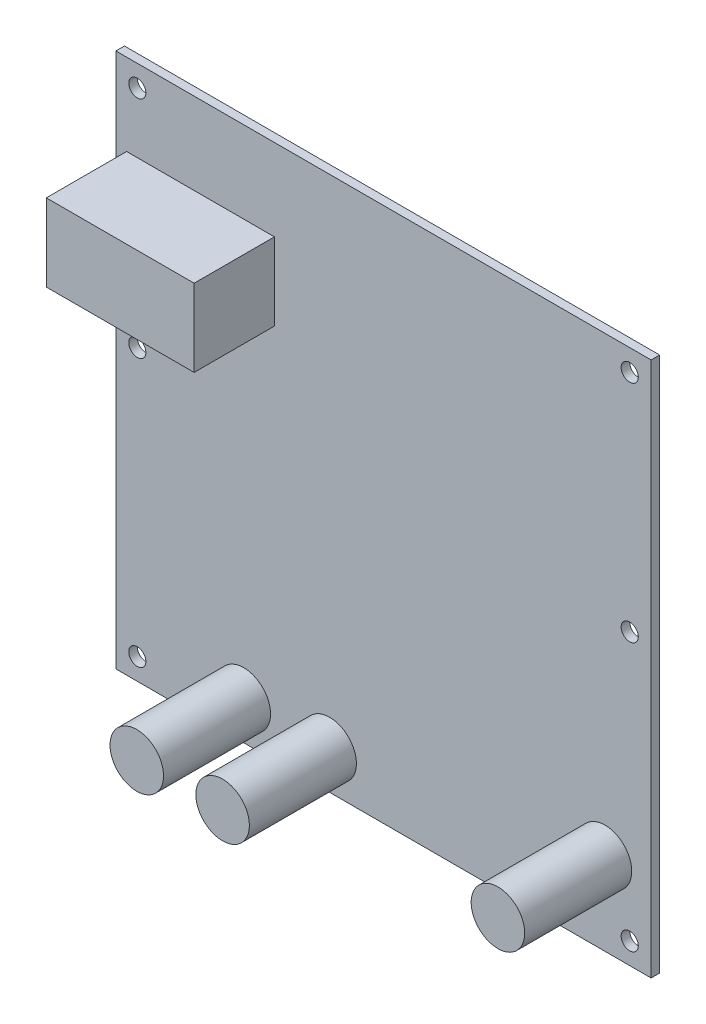
ISO-10303-21;
HEADER;
FILE_DESCRIPTION(('STEP AP214'),'2;1');
FILE_NAME('part.step','',(''),(''),'','','');
FILE_SCHEMA(('AUTOMOTIVE_DESIGN { 1 0 10303 214 1 1 1 1 }'));
ENDSEC;
DATA;
#1=APPLICATION_CONTEXT('core data for automotive mechanical design processes');
#2=APPLICATION_PROTOCOL_DEFINITION('international standard','automotive_design',2000,#1);
#3=PRODUCT_CONTEXT('',#1,'mechanical');
#4=PRODUCT('Part','Part','',(#3));
#5=PRODUCT_RELATED_PRODUCT_CATEGORY('part','',(#4));
#6=PRODUCT_DEFINITION_FORMATION('','',#4);
#7=PRODUCT_DEFINITION_CONTEXT('part definition',#1,'design');
#8=PRODUCT_DEFINITION('design','',#6,#7);
#9=PRODUCT_DEFINITION_SHAPE('','',#8);
#10=(LENGTH_UNIT() NAMED_UNIT(*) SI_UNIT(.MILLI.,.METRE.));
#11=(NAMED_UNIT(*) PLANE_ANGLE_UNIT() SI_UNIT($,.RADIAN.));
#12=(NAMED_UNIT(*) SI_UNIT($,.STERADIAN.) SOLID_ANGLE_UNIT());
#13=UNCERTAINTY_MEASURE_WITH_UNIT(LENGTH_MEASURE(1.E-05),#10,'distance_accuracy_value','');
#14=(GEOMETRIC_REPRESENTATION_CONTEXT(3) GLOBAL_UNCERTAINTY_ASSIGNED_CONTEXT((#13)) GLOBAL_UNIT_ASSIGNED_CONTEXT((#10,
#11,#12)) REPRESENTATION_CONTEXT('',''));
#15=CARTESIAN_POINT('',(0.,0.,0.));
#16=DIRECTION('',(0.,0.,1.));
#17=DIRECTION('',(1.,0.,0.));
#18=AXIS2_PLACEMENT_3D('',#15,#16,#17);
#19=CARTESIAN_POINT('',(0.,0.,1.6));
#20=DIRECTION('',(0.,0.,1.));
#21=DIRECTION('',(1.,0.,0.));
#22=AXIS2_PLACEMENT_3D('',#19,#20,#21);
#23=PLANE('',#22);
#24=CARTESIAN_POINT('',(41.3767384185348,-34.563702956973,1.6));
#25=DIRECTION('',(0.,0.,1.));
#26=DIRECTION('',(1.,0.,0.));
#27=AXIS2_PLACEMENT_3D('',#24,#25,#26);
#28=CIRCLE('',#27,5.);
#29=CARTESIAN_POINT('',(46.3767384185348,-34.563702956973,1.6));
#30=VERTEX_POINT('',#29);
#31=EDGE_CURVE('E132',#30,#30,#28,.T.);
#32=ORIENTED_EDGE('',*,*,#31,.F.);
#33=EDGE_LOOP('',(#32));
#34=FACE_BOUND('',#33,.T.);
#35=CARTESIAN_POINT('',(-10.0631145723398,-42.8428662130074,1.6));
#36=DIRECTION('',(0.,0.,1.));
#37=DIRECTION('',(1.,0.,0.));
#38=AXIS2_PLACEMENT_3D('',#35,#36,#37);
#39=CIRCLE('',#38,5.);
#40=CARTESIAN_POINT('',(-5.06311457233977,-42.8428662130074,1.6));
#41=VERTEX_POINT('',#40);
#42=EDGE_CURVE('E141',#41,#41,#39,.T.);
#43=ORIENTED_EDGE('',*,*,#42,.F.);
#44=EDGE_LOOP('',(#43));
#45=FACE_BOUND('',#44,.T.);
#46=CARTESIAN_POINT('',(-26.0991033731983,-42.8428662130074,1.6));
#47=DIRECTION('',(0.,0.,1.));
#48=DIRECTION('',(1.,0.,0.));
#49=AXIS2_PLACEMENT_3D('',#46,#47,#48);
#50=CIRCLE('',#49,5.);
#51=CARTESIAN_POINT('',(-21.0991033731983,-42.8428662130074,1.6));
#52=VERTEX_POINT('',#51);
#53=EDGE_CURVE('E146',#52,#52,#50,.T.);
#54=ORIENTED_EDGE('',*,*,#53,.F.);
#55=EDGE_LOOP('',(#54));
#56=FACE_BOUND('',#55,.T.);
#57=CARTESIAN_POINT('',(-46.,-46.,1.6));
#58=DIRECTION('',(0.,0.,1.));
#59=DIRECTION('',(1.,0.,0.));
#60=AXIS2_PLACEMENT_3D('',#57,#58,#59);
#61=CIRCLE('',#60,1.6);
#62=CARTESIAN_POINT('',(-44.4,-46.,1.6));
#63=VERTEX_POINT('',#62);
#64=EDGE_CURVE('E161',#63,#63,#61,.T.);
#65=ORIENTED_EDGE('',*,*,#64,.F.);
#66=EDGE_LOOP('',(#65));
#67=FACE_BOUND('',#66,.T.);
#68=CARTESIAN_POINT('',(46.,4.,1.6));
#69=DIRECTION('',(0.,0.,1.));
#70=DIRECTION('',(1.,0.,0.));
#71=AXIS2_PLACEMENT_3D('',#68,#69,#70);
#72=CIRCLE('',#71,1.6);
#73=CARTESIAN_POINT('',(47.6,4.,1.6));
#74=VERTEX_POINT('',#73);
#75=EDGE_CURVE('E173',#74,#74,#72,.T.);
#76=ORIENTED_EDGE('',*,*,#75,.F.);
#77=EDGE_LOOP('',(#76));
#78=FACE_BOUND('',#77,.T.);
#79=CARTESIAN_POINT('',(-46.,46.,1.6));
#80=DIRECTION('',(0.,0.,1.));
#81=DIRECTION('',(1.,0.,0.));
#82=AXIS2_PLACEMENT_3D('',#79,#80,#81);
#83=CIRCLE('',#82,1.6);
#84=CARTESIAN_POINT('',(-44.4,46.,1.6));
#85=VERTEX_POINT('',#84);
#86=EDGE_CURVE('E185',#85,#85,#83,.T.);
#87=ORIENTED_EDGE('',*,*,#86,.F.);
#88=EDGE_LOOP('',(#87));
#89=FACE_BOUND('',#88,.T.);
#90=DIRECTION('',(0.,-1.,0.));
#91=VECTOR('',#90,1.);
#92=CARTESIAN_POINT('',(-50.,50.,1.6));
#93=LINE('',#92,#91);
#94=CARTESIAN_POINT('',(-50.,50.,1.6));
#95=VERTEX_POINT('',#94);
#96=CARTESIAN_POINT('',(-50.,-50.,1.6));
#97=VERTEX_POINT('',#96);
#98=EDGE_CURVE('E191',#95,#97,#93,.T.);
#99=ORIENTED_EDGE('',*,*,#98,.T.);
#100=DIRECTION('',(1.,0.,0.));
#101=VECTOR('',#100,1.);
#102=CARTESIAN_POINT('',(-50.,-50.,1.6));
#103=LINE('',#102,#101);
#104=CARTESIAN_POINT('',(50.,-50.,1.6));
#105=VERTEX_POINT('',#104);
#106=EDGE_CURVE('E85',#97,#105,#103,.T.);
#107=ORIENTED_EDGE('',*,*,#106,.T.);
#108=DIRECTION('',(0.,1.,0.));
#109=VECTOR('',#108,1.);
#110=CARTESIAN_POINT('',(50.,50.,1.6));
#111=LINE('',#110,#109);
#112=CARTESIAN_POINT('',(50.,50.,1.6));
#113=VERTEX_POINT('',#112);
#114=EDGE_CURVE('E194',#105,#113,#111,.T.);
#115=ORIENTED_EDGE('',*,*,#114,.T.);
#116=DIRECTION('',(-1.,0.,0.));
#117=VECTOR('',#116,1.);
#118=CARTESIAN_POINT('',(-50.,50.,1.6));
#119=LINE('',#118,#117);
#120=EDGE_CURVE('E57',#113,#95,#119,.T.);
#121=ORIENTED_EDGE('',*,*,#120,.T.);
#122=EDGE_LOOP('',(#99,#107,#115,#121));
#123=FACE_BOUND('',#122,.T.);
#124=CARTESIAN_POINT('',(46.,46.,1.6));
#125=DIRECTION('',(0.,0.,1.));
#126=DIRECTION('',(1.,0.,0.));
#127=AXIS2_PLACEMENT_3D('',#124,#125,#126);
#128=CIRCLE('',#127,1.6);
#129=CARTESIAN_POINT('',(47.6,46.,1.6));
#130=VERTEX_POINT('',#129);
#131=EDGE_CURVE('E179',#130,#130,#128,.T.);
#132=ORIENTED_EDGE('',*,*,#131,.F.);
#133=EDGE_LOOP('',(#132));
#134=FACE_BOUND('',#133,.T.);
#135=CARTESIAN_POINT('',(-46.,4.,1.6));
#136=DIRECTION('',(0.,0.,1.));
#137=DIRECTION('',(1.,0.,0.));
#138=AXIS2_PLACEMENT_3D('',#135,#136,#137);
#139=CIRCLE('',#138,1.6);
#140=CARTESIAN_POINT('',(-44.4,4.,1.6));
#141=VERTEX_POINT('',#140);
#142=EDGE_CURVE('E167',#141,#141,#139,.T.);
#143=ORIENTED_EDGE('',*,*,#142,.F.);
#144=EDGE_LOOP('',(#143));
#145=FACE_BOUND('',#144,.T.);
#146=CARTESIAN_POINT('',(46.,-46.,1.6));
#147=DIRECTION('',(0.,0.,1.));
#148=DIRECTION('',(1.,0.,0.));
#149=AXIS2_PLACEMENT_3D('',#146,#147,#148);
#150=CIRCLE('',#149,1.6);
#151=CARTESIAN_POINT('',(47.6,-46.,1.6));
#152=VERTEX_POINT('',#151);
#153=EDGE_CURVE('E155',#152,#152,#150,.T.);
#154=ORIENTED_EDGE('',*,*,#153,.F.);
#155=EDGE_LOOP('',(#154));
#156=FACE_BOUND('',#155,.T.);
#157=DIRECTION('',(1.,0.,0.));
#158=VECTOR('',#157,1.);
#159=CARTESIAN_POINT('',(-48.0008888813828,20.2936724459448,1.6));
#160=LINE('',#159,#158);
#161=CARTESIAN_POINT('',(-48.0008888813828,20.2936724459448,1.6));
#162=VERTEX_POINT('',#161);
#163=CARTESIAN_POINT('',(-20.3817225497502,20.2936724459448,1.6));
#164=VERTEX_POINT('',#163);
#165=EDGE_CURVE('E441',#162,#164,#160,.T.);
#166=ORIENTED_EDGE('',*,*,#165,.F.);
#167=DIRECTION('',(0.,-1.,0.));
#168=VECTOR('',#167,1.);
#169=CARTESIAN_POINT('',(-48.0008888813828,34.7306095885358,1.6));
#170=LINE('',#169,#168);
#171=CARTESIAN_POINT('',(-48.0008888813828,34.7306095885358,1.6));
#172=VERTEX_POINT('',#171);
#173=EDGE_CURVE('E130',#172,#162,#170,.T.);
#174=ORIENTED_EDGE('',*,*,#173,.F.);
#175=DIRECTION('',(-1.,0.,0.));
#176=VECTOR('',#175,1.);
#177=CARTESIAN_POINT('',(-48.0008888813828,34.7306095885358,1.6));
#178=LINE('',#177,#176);
#179=CARTESIAN_POINT('',(-20.3817225497502,34.7306095885358,1.6));
#180=VERTEX_POINT('',#179);
#181=EDGE_CURVE('E126',#180,#172,#178,.T.);
#182=ORIENTED_EDGE('',*,*,#181,.F.);
#183=DIRECTION('',(0.,1.,0.));
#184=VECTOR('',#183,1.);
#185=CARTESIAN_POINT('',(-20.3817225497502,34.7306095885358,1.6));
#186=LINE('',#185,#184);
#187=EDGE_CURVE('E438',#164,#180,#186,.T.);
#188=ORIENTED_EDGE('',*,*,#187,.F.);
#189=EDGE_LOOP('',(#166,#174,#182,#188));
#190=FACE_BOUND('',#189,.T.);
#191=ADVANCED_FACE('F33',(#34,#45,#56,#67,#78,#89,#123,#134,#145,#156,#190),#23,.T.);
#192=CARTESIAN_POINT('',(0.,0.,0.));
#193=DIRECTION('',(0.,0.,1.));
#194=DIRECTION('',(1.,0.,0.));
#195=AXIS2_PLACEMENT_3D('',#192,#193,#194);
#196=PLANE('',#195);
#197=DIRECTION('',(0.,-1.,0.));
#198=VECTOR('',#197,1.);
#199=CARTESIAN_POINT('',(-50.,50.,0.));
#200=LINE('',#199,#198);
#201=CARTESIAN_POINT('',(-50.,50.,0.));
#202=VERTEX_POINT('',#201);
#203=CARTESIAN_POINT('',(-50.,-50.,0.));
#204=VERTEX_POINT('',#203);
#205=EDGE_CURVE('E188',#202,#204,#200,.T.);
#206=ORIENTED_EDGE('',*,*,#205,.F.);
#207=DIRECTION('',(-1.,0.,0.));
#208=VECTOR('',#207,1.);
#209=CARTESIAN_POINT('',(-50.,50.,0.));
#210=LINE('',#209,#208);
#211=CARTESIAN_POINT('',(50.,50.,0.));
#212=VERTEX_POINT('',#211);
#213=EDGE_CURVE('E78',#212,#202,#210,.T.);
#214=ORIENTED_EDGE('',*,*,#213,.F.);
#215=DIRECTION('',(0.,1.,0.));
#216=VECTOR('',#215,1.);
#217=CARTESIAN_POINT('',(50.,50.,0.));
#218=LINE('',#217,#216);
#219=CARTESIAN_POINT('',(50.,-50.,0.));
#220=VERTEX_POINT('',#219);
#221=EDGE_CURVE('E202',#220,#212,#218,.T.);
#222=ORIENTED_EDGE('',*,*,#221,.F.);
#223=DIRECTION('',(1.,0.,0.));
#224=VECTOR('',#223,1.);
#225=CARTESIAN_POINT('',(-50.,-50.,0.));
#226=LINE('',#225,#224);
#227=EDGE_CURVE('E200',#204,#220,#226,.T.);
#228=ORIENTED_EDGE('',*,*,#227,.F.);
#229=EDGE_LOOP('',(#206,#214,#222,#228));
#230=FACE_BOUND('',#229,.T.);
#231=CARTESIAN_POINT('',(-46.,46.,0.));
#232=DIRECTION('',(0.,0.,1.));
#233=DIRECTION('',(1.,0.,0.));
#234=AXIS2_PLACEMENT_3D('',#231,#232,#233);
#235=CIRCLE('',#234,1.6);
#236=CARTESIAN_POINT('',(-44.4,46.,0.));
#237=VERTEX_POINT('',#236);
#238=EDGE_CURVE('E182',#237,#237,#235,.T.);
#239=ORIENTED_EDGE('',*,*,#238,.T.);
#240=EDGE_LOOP('',(#239));
#241=FACE_BOUND('',#240,.T.);
#242=CARTESIAN_POINT('',(46.,46.,0.));
#243=DIRECTION('',(0.,0.,1.));
#244=DIRECTION('',(1.,0.,0.));
#245=AXIS2_PLACEMENT_3D('',#242,#243,#244);
#246=CIRCLE('',#245,1.6);
#247=CARTESIAN_POINT('',(47.6,46.,0.));
#248=VERTEX_POINT('',#247);
#249=EDGE_CURVE('E176',#248,#248,#246,.T.);
#250=ORIENTED_EDGE('',*,*,#249,.T.);
#251=EDGE_LOOP('',(#250));
#252=FACE_BOUND('',#251,.T.);
#253=CARTESIAN_POINT('',(46.,4.,0.));
#254=DIRECTION('',(0.,0.,1.));
#255=DIRECTION('',(1.,0.,0.));
#256=AXIS2_PLACEMENT_3D('',#253,#254,#255);
#257=CIRCLE('',#256,1.6);
#258=CARTESIAN_POINT('',(47.6,4.,0.));
#259=VERTEX_POINT('',#258);
#260=EDGE_CURVE('E170',#259,#259,#257,.T.);
#261=ORIENTED_EDGE('',*,*,#260,.T.);
#262=EDGE_LOOP('',(#261));
#263=FACE_BOUND('',#262,.T.);
#264=CARTESIAN_POINT('',(-46.,4.,0.));
#265=DIRECTION('',(0.,0.,1.));
#266=DIRECTION('',(1.,0.,0.));
#267=AXIS2_PLACEMENT_3D('',#264,#265,#266);
#268=CIRCLE('',#267,1.6);
#269=CARTESIAN_POINT('',(-44.4,4.,0.));
#270=VERTEX_POINT('',#269);
#271=EDGE_CURVE('E164',#270,#270,#268,.T.);
#272=ORIENTED_EDGE('',*,*,#271,.T.);
#273=EDGE_LOOP('',(#272));
#274=FACE_BOUND('',#273,.T.);
#275=CARTESIAN_POINT('',(-46.,-46.,0.));
#276=DIRECTION('',(0.,0.,1.));
#277=DIRECTION('',(1.,0.,0.));
#278=AXIS2_PLACEMENT_3D('',#275,#276,#277);
#279=CIRCLE('',#278,1.6);
#280=CARTESIAN_POINT('',(-44.4,-46.,0.));
#281=VERTEX_POINT('',#280);
#282=EDGE_CURVE('E158',#281,#281,#279,.T.);
#283=ORIENTED_EDGE('',*,*,#282,.T.);
#284=EDGE_LOOP('',(#283));
#285=FACE_BOUND('',#284,.T.);
#286=CARTESIAN_POINT('',(46.,-46.,0.));
#287=DIRECTION('',(0.,0.,1.));
#288=DIRECTION('',(1.,0.,0.));
#289=AXIS2_PLACEMENT_3D('',#286,#287,#288);
#290=CIRCLE('',#289,1.6);
#291=CARTESIAN_POINT('',(47.6,-46.,0.));
#292=VERTEX_POINT('',#291);
#293=EDGE_CURVE('E152',#292,#292,#290,.T.);
#294=ORIENTED_EDGE('',*,*,#293,.T.);
#295=EDGE_LOOP('',(#294));
#296=FACE_BOUND('',#295,.T.);
#297=ADVANCED_FACE('F215',(#230,#241,#252,#263,#274,#285,#296),#196,.F.);
#298=CARTESIAN_POINT('',(-50.,50.,1.6));
#299=DIRECTION('',(1.,0.,0.));
#300=DIRECTION('',(0.,1.,0.));
#301=AXIS2_PLACEMENT_3D('',#298,#299,#300);
#302=PLANE('',#301);
#303=ORIENTED_EDGE('',*,*,#205,.T.);
#304=DIRECTION('',(0.,0.,-1.));
#305=VECTOR('',#304,1.);
#306=CARTESIAN_POINT('',(-50.,-50.,1.6));
#307=LINE('',#306,#305);
#308=EDGE_CURVE('E11',#97,#204,#307,.T.);
#309=ORIENTED_EDGE('',*,*,#308,.F.);
#310=ORIENTED_EDGE('',*,*,#98,.F.);
#311=DIRECTION('',(0.,0.,-1.));
#312=VECTOR('',#311,1.);
#313=CARTESIAN_POINT('',(-50.,50.,1.6));
#314=LINE('',#313,#312);
#315=EDGE_CURVE('E197',#95,#202,#314,.T.);
#316=ORIENTED_EDGE('',*,*,#315,.T.);
#317=EDGE_LOOP('',(#303,#309,#310,#316));
#318=FACE_BOUND('',#317,.T.);
#319=ADVANCED_FACE('F35',(#318),#302,.F.);
#320=CARTESIAN_POINT('',(-50.,-50.,1.6));
#321=DIRECTION('',(0.,1.,0.));
#322=DIRECTION('',(0.,0.,1.));
#323=AXIS2_PLACEMENT_3D('',#320,#321,#322);
#324=PLANE('',#323);
#325=ORIENTED_EDGE('',*,*,#227,.T.);
#326=DIRECTION('',(0.,0.,-1.));
#327=VECTOR('',#326,1.);
#328=CARTESIAN_POINT('',(50.,-50.,1.6));
#329=LINE('',#328,#327);
#330=EDGE_CURVE('E41',#105,#220,#329,.T.);
#331=ORIENTED_EDGE('',*,*,#330,.F.);
#332=ORIENTED_EDGE('',*,*,#106,.F.);
#333=ORIENTED_EDGE('',*,*,#308,.T.);
#334=EDGE_LOOP('',(#325,#331,#332,#333));
#335=FACE_BOUND('',#334,.T.);
#336=ADVANCED_FACE('F231',(#335),#324,.F.);
#337=CARTESIAN_POINT('',(50.,50.,1.6));
#338=DIRECTION('',(-1.,0.,0.));
#339=DIRECTION('',(0.,-1.,0.));
#340=AXIS2_PLACEMENT_3D('',#337,#338,#339);
#341=PLANE('',#340);
#342=ORIENTED_EDGE('',*,*,#221,.T.);
#343=DIRECTION('',(0.,0.,-1.));
#344=VECTOR('',#343,1.);
#345=CARTESIAN_POINT('',(50.,50.,1.6));
#346=LINE('',#345,#344);
#347=EDGE_CURVE('E206',#113,#212,#346,.T.);
#348=ORIENTED_EDGE('',*,*,#347,.F.);
#349=ORIENTED_EDGE('',*,*,#114,.F.);
#350=ORIENTED_EDGE('',*,*,#330,.T.);
#351=EDGE_LOOP('',(#342,#348,#349,#350));
#352=FACE_BOUND('',#351,.T.);
#353=ADVANCED_FACE('F211',(#352),#341,.F.);
#354=CARTESIAN_POINT('',(-50.,50.,1.6));
#355=DIRECTION('',(0.,-1.,0.));
#356=DIRECTION('',(0.,0.,-1.));
#357=AXIS2_PLACEMENT_3D('',#354,#355,#356);
#358=PLANE('',#357);
#359=ORIENTED_EDGE('',*,*,#213,.T.);
#360=ORIENTED_EDGE('',*,*,#315,.F.);
#361=ORIENTED_EDGE('',*,*,#120,.F.);
#362=ORIENTED_EDGE('',*,*,#347,.T.);
#363=EDGE_LOOP('',(#359,#360,#361,#362));
#364=FACE_BOUND('',#363,.T.);
#365=ADVANCED_FACE('F220',(#364),#358,.F.);
#366=CARTESIAN_POINT('',(-46.,46.,1.6));
#367=DIRECTION('',(0.,0.,-1.));
#368=DIRECTION('',(-1.,0.,0.));
#369=AXIS2_PLACEMENT_3D('',#366,#367,#368);
#370=CYLINDRICAL_SURFACE('',#369,1.6);
#371=ORIENTED_EDGE('',*,*,#86,.T.);
#372=EDGE_LOOP('',(#371));
#373=FACE_BOUND('',#372,.T.);
#374=ORIENTED_EDGE('',*,*,#238,.F.);
#375=EDGE_LOOP('',(#374));
#376=FACE_BOUND('',#375,.T.);
#377=ADVANCED_FACE('F222',(#373,#376),#370,.F.);
#378=CARTESIAN_POINT('',(46.,46.,1.6));
#379=DIRECTION('',(0.,0.,-1.));
#380=DIRECTION('',(-1.,0.,0.));
#381=AXIS2_PLACEMENT_3D('',#378,#379,#380);
#382=CYLINDRICAL_SURFACE('',#381,1.6);
#383=ORIENTED_EDGE('',*,*,#131,.T.);
#384=EDGE_LOOP('',(#383));
#385=FACE_BOUND('',#384,.T.);
#386=ORIENTED_EDGE('',*,*,#249,.F.);
#387=EDGE_LOOP('',(#386));
#388=FACE_BOUND('',#387,.T.);
#389=ADVANCED_FACE('F228',(#385,#388),#382,.F.);
#390=CARTESIAN_POINT('',(46.,4.,1.6));
#391=DIRECTION('',(0.,0.,-1.));
#392=DIRECTION('',(-1.,0.,0.));
#393=AXIS2_PLACEMENT_3D('',#390,#391,#392);
#394=CYLINDRICAL_SURFACE('',#393,1.6);
#395=ORIENTED_EDGE('',*,*,#75,.T.);
#396=EDGE_LOOP('',(#395));
#397=FACE_BOUND('',#396,.T.);
#398=ORIENTED_EDGE('',*,*,#260,.F.);
#399=EDGE_LOOP('',(#398));
#400=FACE_BOUND('',#399,.T.);
#401=ADVANCED_FACE('F245',(#397,#400),#394,.F.);
#402=CARTESIAN_POINT('',(-46.,4.,1.6));
#403=DIRECTION('',(0.,0.,-1.));
#404=DIRECTION('',(-1.,0.,0.));
#405=AXIS2_PLACEMENT_3D('',#402,#403,#404);
#406=CYLINDRICAL_SURFACE('',#405,1.6);
#407=ORIENTED_EDGE('',*,*,#142,.T.);
#408=EDGE_LOOP('',(#407));
#409=FACE_BOUND('',#408,.T.);
#410=ORIENTED_EDGE('',*,*,#271,.F.);
#411=EDGE_LOOP('',(#410));
#412=FACE_BOUND('',#411,.T.);
#413=ADVANCED_FACE('F249',(#409,#412),#406,.F.);
#414=CARTESIAN_POINT('',(-46.,-46.,1.6));
#415=DIRECTION('',(0.,0.,-1.));
#416=DIRECTION('',(-1.,0.,0.));
#417=AXIS2_PLACEMENT_3D('',#414,#415,#416);
#418=CYLINDRICAL_SURFACE('',#417,1.6);
#419=ORIENTED_EDGE('',*,*,#64,.T.);
#420=EDGE_LOOP('',(#419));
#421=FACE_BOUND('',#420,.T.);
#422=ORIENTED_EDGE('',*,*,#282,.F.);
#423=EDGE_LOOP('',(#422));
#424=FACE_BOUND('',#423,.T.);
#425=ADVANCED_FACE('F253',(#421,#424),#418,.F.);
#426=CARTESIAN_POINT('',(46.,-46.,1.6));
#427=DIRECTION('',(0.,0.,-1.));
#428=DIRECTION('',(-1.,0.,0.));
#429=AXIS2_PLACEMENT_3D('',#426,#427,#428);
#430=CYLINDRICAL_SURFACE('',#429,1.6);
#431=ORIENTED_EDGE('',*,*,#153,.T.);
#432=EDGE_LOOP('',(#431));
#433=FACE_BOUND('',#432,.T.);
#434=ORIENTED_EDGE('',*,*,#293,.F.);
#435=EDGE_LOOP('',(#434));
#436=FACE_BOUND('',#435,.T.);
#437=ADVANCED_FACE('F257',(#433,#436),#430,.F.);
#438=CARTESIAN_POINT('',(-26.0991033731983,-42.8428662130074,21.6));
#439=DIRECTION('',(0.,0.,-1.));
#440=DIRECTION('',(-1.,0.,0.));
#441=AXIS2_PLACEMENT_3D('',#438,#439,#440);
#442=CYLINDRICAL_SURFACE('',#441,5.);
#443=CARTESIAN_POINT('',(-26.0991033731983,-42.8428662130074,21.6));
#444=DIRECTION('',(0.,0.,1.));
#445=DIRECTION('',(1.,0.,0.));
#446=AXIS2_PLACEMENT_3D('',#443,#444,#445);
#447=CIRCLE('',#446,5.);
#448=CARTESIAN_POINT('',(-21.0991033731983,-42.8428662130074,21.6));
#449=VERTEX_POINT('',#448);
#450=EDGE_CURVE('E149',#449,#449,#447,.T.);
#451=ORIENTED_EDGE('',*,*,#450,.F.);
#452=EDGE_LOOP('',(#451));
#453=FACE_BOUND('',#452,.T.);
#454=ORIENTED_EDGE('',*,*,#53,.T.);
#455=EDGE_LOOP('',(#454));
#456=FACE_BOUND('',#455,.T.);
#457=ADVANCED_FACE('F261',(#453,#456),#442,.T.);
#458=CARTESIAN_POINT('',(-26.0991033731983,-42.8428662130074,21.6));
#459=DIRECTION('',(0.,0.,1.));
#460=DIRECTION('',(1.,0.,0.));
#461=AXIS2_PLACEMENT_3D('',#458,#459,#460);
#462=PLANE('',#461);
#463=ORIENTED_EDGE('',*,*,#450,.T.);
#464=EDGE_LOOP('',(#463));
#465=FACE_BOUND('',#464,.T.);
#466=ADVANCED_FACE('F265',(#465),#462,.T.);
#467=CARTESIAN_POINT('',(-10.0631145723398,-42.8428662130074,21.6));
#468=DIRECTION('',(0.,0.,-1.));
#469=DIRECTION('',(-1.,0.,0.));
#470=AXIS2_PLACEMENT_3D('',#467,#468,#469);
#471=CYLINDRICAL_SURFACE('',#470,5.);
#472=CARTESIAN_POINT('',(-10.0631145723398,-42.8428662130074,21.6));
#473=DIRECTION('',(0.,0.,1.));
#474=DIRECTION('',(1.,0.,0.));
#475=AXIS2_PLACEMENT_3D('',#472,#473,#474);
#476=CIRCLE('',#475,5.);
#477=CARTESIAN_POINT('',(-5.06311457233977,-42.8428662130074,21.6));
#478=VERTEX_POINT('',#477);
#479=EDGE_CURVE('E143',#478,#478,#476,.T.);
#480=ORIENTED_EDGE('',*,*,#479,.F.);
#481=EDGE_LOOP('',(#480));
#482=FACE_BOUND('',#481,.T.);
#483=ORIENTED_EDGE('',*,*,#42,.T.);
#484=EDGE_LOOP('',(#483));
#485=FACE_BOUND('',#484,.T.);
#486=ADVANCED_FACE('F269',(#482,#485),#471,.T.);
#487=CARTESIAN_POINT('',(-10.0631145723398,-42.8428662130074,21.6));
#488=DIRECTION('',(0.,0.,1.));
#489=DIRECTION('',(1.,0.,0.));
#490=AXIS2_PLACEMENT_3D('',#487,#488,#489);
#491=PLANE('',#490);
#492=ORIENTED_EDGE('',*,*,#479,.T.);
#493=EDGE_LOOP('',(#492));
#494=FACE_BOUND('',#493,.T.);
#495=ADVANCED_FACE('F273',(#494),#491,.T.);
#496=CARTESIAN_POINT('',(41.3767384185348,-34.563702956973,21.6));
#497=DIRECTION('',(0.,0.,-1.));
#498=DIRECTION('',(-1.,0.,0.));
#499=AXIS2_PLACEMENT_3D('',#496,#497,#498);
#500=CYLINDRICAL_SURFACE('',#499,5.);
#501=CARTESIAN_POINT('',(41.3767384185348,-34.563702956973,21.6));
#502=DIRECTION('',(0.,0.,1.));
#503=DIRECTION('',(1.,0.,0.));
#504=AXIS2_PLACEMENT_3D('',#501,#502,#503);
#505=CIRCLE('',#504,5.);
#506=CARTESIAN_POINT('',(46.3767384185348,-34.563702956973,21.6));
#507=VERTEX_POINT('',#506);
#508=EDGE_CURVE('E135',#507,#507,#505,.T.);
#509=ORIENTED_EDGE('',*,*,#508,.F.);
#510=EDGE_LOOP('',(#509));
#511=FACE_BOUND('',#510,.T.);
#512=ORIENTED_EDGE('',*,*,#31,.T.);
#513=EDGE_LOOP('',(#512));
#514=FACE_BOUND('',#513,.T.);
#515=ADVANCED_FACE('F277',(#511,#514),#500,.T.);
#516=CARTESIAN_POINT('',(41.3767384185348,-34.563702956973,21.6));
#517=DIRECTION('',(0.,0.,1.));
#518=DIRECTION('',(1.,0.,0.));
#519=AXIS2_PLACEMENT_3D('',#516,#517,#518);
#520=PLANE('',#519);
#521=ORIENTED_EDGE('',*,*,#508,.T.);
#522=EDGE_LOOP('',(#521));
#523=FACE_BOUND('',#522,.T.);
#524=ADVANCED_FACE('F281',(#523),#520,.T.);
#525=CARTESIAN_POINT('',(-48.0008888813828,34.7306095885358,16.6));
#526=DIRECTION('',(1.,0.,0.));
#527=DIRECTION('',(0.,0.,-1.));
#528=AXIS2_PLACEMENT_3D('',#525,#526,#527);
#529=PLANE('',#528);
#530=ORIENTED_EDGE('',*,*,#173,.T.);
#531=DIRECTION('',(0.,0.,-1.));
#532=VECTOR('',#531,1.);
#533=CARTESIAN_POINT('',(-48.0008888813828,20.2936724459448,16.6));
#534=LINE('',#533,#532);
#535=CARTESIAN_POINT('',(-48.0008888813828,20.2936724459448,16.6));
#536=VERTEX_POINT('',#535);
#537=EDGE_CURVE('E111',#536,#162,#534,.T.);
#538=ORIENTED_EDGE('',*,*,#537,.F.);
#539=DIRECTION('',(0.,-1.,0.));
#540=VECTOR('',#539,1.);
#541=CARTESIAN_POINT('',(-48.0008888813828,34.7306095885358,16.6));
#542=LINE('',#541,#540);
#543=CARTESIAN_POINT('',(-48.0008888813828,34.7306095885358,16.6));
#544=VERTEX_POINT('',#543);
#545=EDGE_CURVE('E118',#544,#536,#542,.T.);
#546=ORIENTED_EDGE('',*,*,#545,.F.);
#547=DIRECTION('',(0.,0.,-1.));
#548=VECTOR('',#547,1.);
#549=CARTESIAN_POINT('',(-48.0008888813828,34.7306095885358,16.6));
#550=LINE('',#549,#548);
#551=EDGE_CURVE('E435',#544,#172,#550,.T.);
#552=ORIENTED_EDGE('',*,*,#551,.T.);
#553=EDGE_LOOP('',(#530,#538,#546,#552));
#554=FACE_BOUND('',#553,.T.);
#555=ADVANCED_FACE('F128',(#554),#529,.F.);
#556=CARTESIAN_POINT('',(-48.0008888813828,20.2936724459448,16.6));
#557=DIRECTION('',(0.,1.,0.));
#558=DIRECTION('',(0.,0.,1.));
#559=AXIS2_PLACEMENT_3D('',#556,#557,#558);
#560=PLANE('',#559);
#561=ORIENTED_EDGE('',*,*,#165,.T.);
#562=DIRECTION('',(0.,0.,-1.));
#563=VECTOR('',#562,1.);
#564=CARTESIAN_POINT('',(-20.3817225497502,20.2936724459448,16.6));
#565=LINE('',#564,#563);
#566=CARTESIAN_POINT('',(-20.3817225497502,20.2936724459448,16.6));
#567=VERTEX_POINT('',#566);
#568=EDGE_CURVE('E114',#567,#164,#565,.T.);
#569=ORIENTED_EDGE('',*,*,#568,.F.);
#570=DIRECTION('',(1.,0.,0.));
#571=VECTOR('',#570,1.);
#572=CARTESIAN_POINT('',(-48.0008888813828,20.2936724459448,16.6));
#573=LINE('',#572,#571);
#574=EDGE_CURVE('E107',#536,#567,#573,.T.);
#575=ORIENTED_EDGE('',*,*,#574,.F.);
#576=ORIENTED_EDGE('',*,*,#537,.T.);
#577=EDGE_LOOP('',(#561,#569,#575,#576));
#578=FACE_BOUND('',#577,.T.);
#579=ADVANCED_FACE('F109',(#578),#560,.F.);
#580=CARTESIAN_POINT('',(-20.3817225497502,34.7306095885358,16.6));
#581=DIRECTION('',(-1.,0.,0.));
#582=DIRECTION('',(0.,0.,1.));
#583=AXIS2_PLACEMENT_3D('',#580,#581,#582);
#584=PLANE('',#583);
#585=ORIENTED_EDGE('',*,*,#187,.T.);
#586=DIRECTION('',(0.,0.,-1.));
#587=VECTOR('',#586,1.);
#588=CARTESIAN_POINT('',(-20.3817225497502,34.7306095885358,16.6));
#589=LINE('',#588,#587);
#590=CARTESIAN_POINT('',(-20.3817225497502,34.7306095885358,16.6));
#591=VERTEX_POINT('',#590);
#592=EDGE_CURVE('E48',#591,#180,#589,.T.);
#593=ORIENTED_EDGE('',*,*,#592,.F.);
#594=DIRECTION('',(0.,1.,0.));
#595=VECTOR('',#594,1.);
#596=CARTESIAN_POINT('',(-20.3817225497502,34.7306095885358,16.6));
#597=LINE('',#596,#595);
#598=EDGE_CURVE('E117',#567,#591,#597,.T.);
#599=ORIENTED_EDGE('',*,*,#598,.F.);
#600=ORIENTED_EDGE('',*,*,#568,.T.);
#601=EDGE_LOOP('',(#585,#593,#599,#600));
#602=FACE_BOUND('',#601,.T.);
#603=ADVANCED_FACE('F290',(#602),#584,.F.);
#604=CARTESIAN_POINT('',(-48.0008888813828,34.7306095885358,16.6));
#605=DIRECTION('',(0.,-1.,0.));
#606=DIRECTION('',(0.,0.,-1.));
#607=AXIS2_PLACEMENT_3D('',#604,#605,#606);
#608=PLANE('',#607);
#609=ORIENTED_EDGE('',*,*,#181,.T.);
#610=ORIENTED_EDGE('',*,*,#551,.F.);
#611=DIRECTION('',(-1.,0.,0.));
#612=VECTOR('',#611,1.);
#613=CARTESIAN_POINT('',(-48.0008888813828,34.7306095885358,16.6));
#614=LINE('',#613,#612);
#615=EDGE_CURVE('E122',#591,#544,#614,.T.);
#616=ORIENTED_EDGE('',*,*,#615,.F.);
#617=ORIENTED_EDGE('',*,*,#592,.T.);
#618=EDGE_LOOP('',(#609,#610,#616,#617));
#619=FACE_BOUND('',#618,.T.);
#620=ADVANCED_FACE('F293',(#619),#608,.F.);
#621=CARTESIAN_POINT('',(0.,0.,16.6));
#622=DIRECTION('',(0.,0.,1.));
#623=DIRECTION('',(1.,0.,0.));
#624=AXIS2_PLACEMENT_3D('',#621,#622,#623);
#625=PLANE('',#624);
#626=ORIENTED_EDGE('',*,*,#545,.T.);
#627=ORIENTED_EDGE('',*,*,#574,.T.);
#628=ORIENTED_EDGE('',*,*,#598,.T.);
#629=ORIENTED_EDGE('',*,*,#615,.T.);
#630=EDGE_LOOP('',(#626,#627,#628,#629));
#631=FACE_BOUND('',#630,.T.);
#632=ADVANCED_FACE('F121',(#631),#625,.T.);
#633=CLOSED_SHELL('',(#191,#297,#319,#336,#353,#365,#377,#389,#401,#413,#425,#437,#457,#466,
#486,#495,#515,#524,#555,#579,#603,#620,#632));
#634=MANIFOLD_SOLID_BREP('B2',#633);
#635=ADVANCED_BREP_SHAPE_REPRESENTATION('',(#18,#634),#14);
#636=SHAPE_DEFINITION_REPRESENTATION(#9,#635);
ENDSEC;
END-ISO-10303-21;
